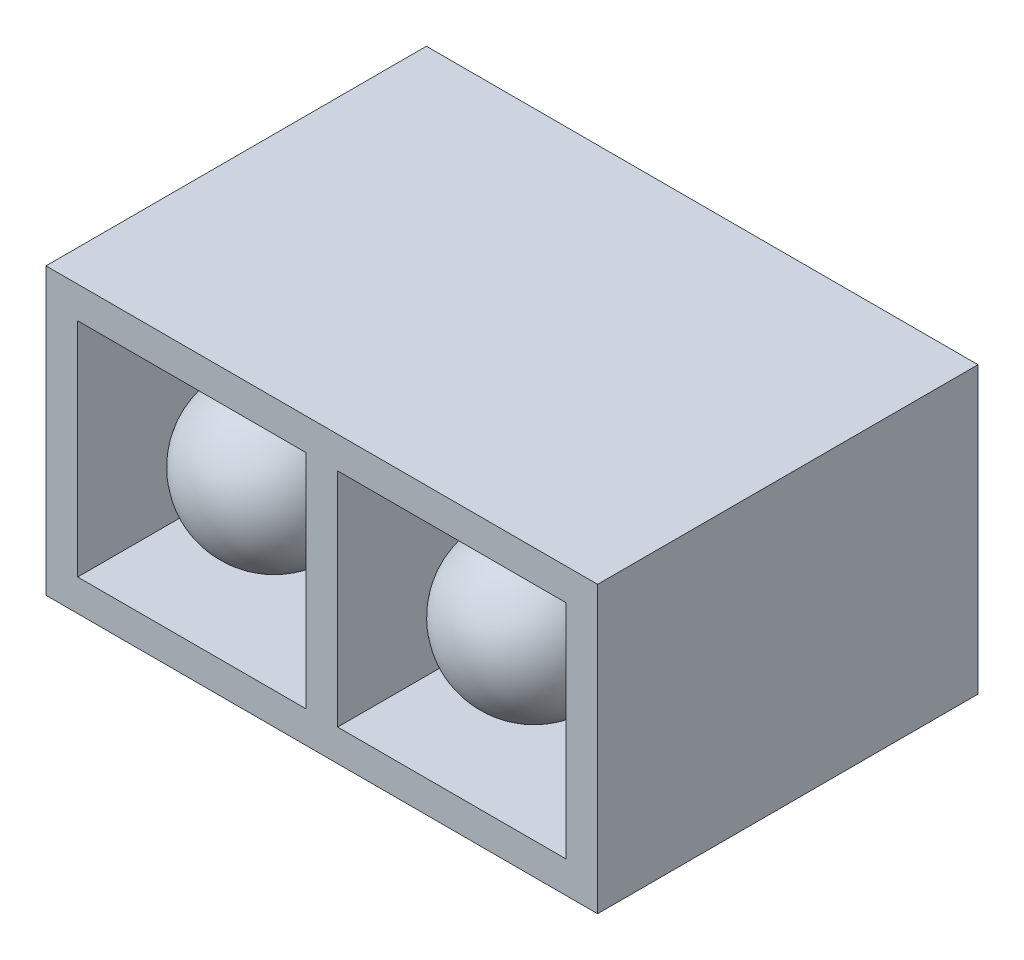
ISO-10303-21;
HEADER;
FILE_DESCRIPTION(('STEP AP214'),'2;1');
FILE_NAME('part.step','',(''),(''),'','','');
FILE_SCHEMA(('AUTOMOTIVE_DESIGN { 1 0 10303 214 1 1 1 1 }'));
ENDSEC;
DATA;
#1=APPLICATION_CONTEXT('core data for automotive mechanical design processes');
#2=APPLICATION_PROTOCOL_DEFINITION('international standard','automotive_design',2000,#1);
#3=PRODUCT_CONTEXT('',#1,'mechanical');
#4=PRODUCT('Part','Part','',(#3));
#5=PRODUCT_RELATED_PRODUCT_CATEGORY('part','',(#4));
#6=PRODUCT_DEFINITION_FORMATION('','',#4);
#7=PRODUCT_DEFINITION_CONTEXT('part definition',#1,'design');
#8=PRODUCT_DEFINITION('design','',#6,#7);
#9=PRODUCT_DEFINITION_SHAPE('','',#8);
#10=(LENGTH_UNIT() NAMED_UNIT(*) SI_UNIT(.MILLI.,.METRE.));
#11=(NAMED_UNIT(*) PLANE_ANGLE_UNIT() SI_UNIT($,.RADIAN.));
#12=(NAMED_UNIT(*) SI_UNIT($,.STERADIAN.) SOLID_ANGLE_UNIT());
#13=UNCERTAINTY_MEASURE_WITH_UNIT(LENGTH_MEASURE(1.E-05),#10,'distance_accuracy_value','');
#14=(GEOMETRIC_REPRESENTATION_CONTEXT(3) GLOBAL_UNCERTAINTY_ASSIGNED_CONTEXT((#13)) GLOBAL_UNIT_ASSIGNED_CONTEXT((#10,
#11,#12)) REPRESENTATION_CONTEXT('',''));
#15=CARTESIAN_POINT('',(0.,0.,0.));
#16=DIRECTION('',(0.,0.,1.));
#17=DIRECTION('',(1.,0.,0.));
#18=AXIS2_PLACEMENT_3D('',#15,#16,#17);
#19=CARTESIAN_POINT('',(-4.35,-1.75,6.));
#20=DIRECTION('',(0.,1.,0.));
#21=DIRECTION('',(-1.,0.,0.));
#22=AXIS2_PLACEMENT_3D('',#19,#20,#21);
#23=PLANE('',#22);
#24=DIRECTION('',(0.,0.,-1.));
#25=VECTOR('',#24,1.);
#26=CARTESIAN_POINT('',(-0.249999999999999,-1.75,6.));
#27=LINE('',#26,#25);
#28=CARTESIAN_POINT('',(-0.249999999999999,-1.75,6.));
#29=VERTEX_POINT('',#28);
#30=CARTESIAN_POINT('',(-0.249999999999999,-1.75,2.));
#31=VERTEX_POINT('',#30);
#32=EDGE_CURVE('E157',#29,#31,#27,.T.);
#33=ORIENTED_EDGE('',*,*,#32,.T.);
#34=DIRECTION('',(-1.,0.,0.));
#35=VECTOR('',#34,1.);
#36=CARTESIAN_POINT('',(-4.35,-1.75,2.));
#37=LINE('',#36,#35);
#38=CARTESIAN_POINT('',(-3.85,-1.75,2.));
#39=VERTEX_POINT('',#38);
#40=EDGE_CURVE('E73',#31,#39,#37,.T.);
#41=ORIENTED_EDGE('',*,*,#40,.T.);
#42=DIRECTION('',(0.,0.,-1.));
#43=VECTOR('',#42,1.);
#44=CARTESIAN_POINT('',(-3.85,-1.75,6.));
#45=LINE('',#44,#43);
#46=CARTESIAN_POINT('',(-3.85,-1.75,6.));
#47=VERTEX_POINT('',#46);
#48=EDGE_CURVE('E213',#47,#39,#45,.T.);
#49=ORIENTED_EDGE('',*,*,#48,.F.);
#50=DIRECTION('',(1.,0.,0.));
#51=VECTOR('',#50,1.);
#52=CARTESIAN_POINT('',(-4.35,-1.75,6.));
#53=LINE('',#52,#51);
#54=EDGE_CURVE('E198',#47,#29,#53,.T.);
#55=ORIENTED_EDGE('',*,*,#54,.T.);
#56=EDGE_LOOP('',(#33,#41,#49,#55));
#57=FACE_BOUND('',#56,.T.);
#58=ADVANCED_FACE('F58',(#57),#23,.T.);
#59=DIRECTION('',(0.,0.,-1.));
#60=VECTOR('',#59,1.);
#61=CARTESIAN_POINT('',(3.85,-1.75,6.));
#62=LINE('',#61,#60);
#63=CARTESIAN_POINT('',(3.85,-1.75,6.));
#64=VERTEX_POINT('',#63);
#65=CARTESIAN_POINT('',(3.85,-1.75,2.));
#66=VERTEX_POINT('',#65);
#67=EDGE_CURVE('E164',#64,#66,#62,.T.);
#68=ORIENTED_EDGE('',*,*,#67,.T.);
#69=DIRECTION('',(-1.,0.,0.));
#70=VECTOR('',#69,1.);
#71=CARTESIAN_POINT('',(-4.35,-1.75,2.));
#72=LINE('',#71,#70);
#73=CARTESIAN_POINT('',(0.25,-1.75,2.));
#74=VERTEX_POINT('',#73);
#75=EDGE_CURVE('E161',#66,#74,#72,.T.);
#76=ORIENTED_EDGE('',*,*,#75,.T.);
#77=DIRECTION('',(0.,0.,1.));
#78=VECTOR('',#77,1.);
#79=CARTESIAN_POINT('',(0.250000000000001,-1.75,6.));
#80=LINE('',#79,#78);
#81=CARTESIAN_POINT('',(0.25,-1.75,6.));
#82=VERTEX_POINT('',#81);
#83=EDGE_CURVE('E149',#74,#82,#80,.T.);
#84=ORIENTED_EDGE('',*,*,#83,.T.);
#85=EDGE_CURVE('E197',#82,#64,#53,.T.);
#86=ORIENTED_EDGE('',*,*,#85,.T.);
#87=EDGE_LOOP('',(#68,#76,#84,#86));
#88=FACE_BOUND('',#87,.T.);
#89=ADVANCED_FACE('F162',(#88),#23,.T.);
#90=CARTESIAN_POINT('',(-4.35,1.75,6.));
#91=DIRECTION('',(0.,-1.,0.));
#92=DIRECTION('',(1.,0.,0.));
#93=AXIS2_PLACEMENT_3D('',#90,#91,#92);
#94=PLANE('',#93);
#95=DIRECTION('',(0.,0.,-1.));
#96=VECTOR('',#95,1.);
#97=CARTESIAN_POINT('',(-3.85,1.75,6.));
#98=LINE('',#97,#96);
#99=CARTESIAN_POINT('',(-3.85,1.75,6.));
#100=VERTEX_POINT('',#99);
#101=CARTESIAN_POINT('',(-3.85,1.75,2.));
#102=VERTEX_POINT('',#101);
#103=EDGE_CURVE('E208',#100,#102,#98,.T.);
#104=ORIENTED_EDGE('',*,*,#103,.T.);
#105=DIRECTION('',(1.,0.,0.));
#106=VECTOR('',#105,1.);
#107=CARTESIAN_POINT('',(-4.35,1.75,2.));
#108=LINE('',#107,#106);
#109=CARTESIAN_POINT('',(-0.25,1.75,2.));
#110=VERTEX_POINT('',#109);
#111=EDGE_CURVE('E185',#102,#110,#108,.T.);
#112=ORIENTED_EDGE('',*,*,#111,.T.);
#113=DIRECTION('',(0.,0.,1.));
#114=VECTOR('',#113,1.);
#115=CARTESIAN_POINT('',(-0.25,1.75,6.));
#116=LINE('',#115,#114);
#117=CARTESIAN_POINT('',(-0.25,1.75,6.));
#118=VERTEX_POINT('',#117);
#119=EDGE_CURVE('E66',#110,#118,#116,.T.);
#120=ORIENTED_EDGE('',*,*,#119,.T.);
#121=DIRECTION('',(-1.,0.,0.));
#122=VECTOR('',#121,1.);
#123=CARTESIAN_POINT('',(-4.35,1.75,6.));
#124=LINE('',#123,#122);
#125=EDGE_CURVE('E204',#118,#100,#124,.T.);
#126=ORIENTED_EDGE('',*,*,#125,.T.);
#127=EDGE_LOOP('',(#104,#112,#120,#126));
#128=FACE_BOUND('',#127,.T.);
#129=ADVANCED_FACE('F247',(#128),#94,.T.);
#130=DIRECTION('',(0.,0.,-1.));
#131=VECTOR('',#130,1.);
#132=CARTESIAN_POINT('',(0.25,1.75,6.));
#133=LINE('',#132,#131);
#134=CARTESIAN_POINT('',(0.25,1.75,6.));
#135=VERTEX_POINT('',#134);
#136=CARTESIAN_POINT('',(0.25,1.75,2.));
#137=VERTEX_POINT('',#136);
#138=EDGE_CURVE('E244',#135,#137,#133,.T.);
#139=ORIENTED_EDGE('',*,*,#138,.T.);
#140=DIRECTION('',(1.,0.,0.));
#141=VECTOR('',#140,1.);
#142=CARTESIAN_POINT('',(-4.35,1.75,2.));
#143=LINE('',#142,#141);
#144=CARTESIAN_POINT('',(3.85,1.75,2.));
#145=VERTEX_POINT('',#144);
#146=EDGE_CURVE('E168',#137,#145,#143,.T.);
#147=ORIENTED_EDGE('',*,*,#146,.T.);
#148=DIRECTION('',(0.,0.,-1.));
#149=VECTOR('',#148,1.);
#150=CARTESIAN_POINT('',(3.85,1.75,6.));
#151=LINE('',#150,#149);
#152=CARTESIAN_POINT('',(3.85,1.75,6.));
#153=VERTEX_POINT('',#152);
#154=EDGE_CURVE('E210',#153,#145,#151,.T.);
#155=ORIENTED_EDGE('',*,*,#154,.F.);
#156=EDGE_CURVE('E205',#153,#135,#124,.T.);
#157=ORIENTED_EDGE('',*,*,#156,.T.);
#158=EDGE_LOOP('',(#139,#147,#155,#157));
#159=FACE_BOUND('',#158,.T.);
#160=ADVANCED_FACE('F285',(#159),#94,.T.);
#161=CARTESIAN_POINT('',(-3.85,2.25,6.));
#162=DIRECTION('',(1.,0.,0.));
#163=DIRECTION('',(0.,0.,-1.));
#164=AXIS2_PLACEMENT_3D('',#161,#162,#163);
#165=PLANE('',#164);
#166=ORIENTED_EDGE('',*,*,#48,.T.);
#167=DIRECTION('',(0.,1.,0.));
#168=VECTOR('',#167,1.);
#169=CARTESIAN_POINT('',(-3.85,2.25,2.));
#170=LINE('',#169,#168);
#171=EDGE_CURVE('E80',#39,#102,#170,.T.);
#172=ORIENTED_EDGE('',*,*,#171,.T.);
#173=ORIENTED_EDGE('',*,*,#103,.F.);
#174=DIRECTION('',(0.,-1.,0.));
#175=VECTOR('',#174,1.);
#176=CARTESIAN_POINT('',(-3.85,2.25,6.));
#177=LINE('',#176,#175);
#178=EDGE_CURVE('E195',#100,#47,#177,.T.);
#179=ORIENTED_EDGE('',*,*,#178,.T.);
#180=EDGE_LOOP('',(#166,#172,#173,#179));
#181=FACE_BOUND('',#180,.T.);
#182=ADVANCED_FACE('F257',(#181),#165,.T.);
#183=CARTESIAN_POINT('',(3.85,2.25,6.));
#184=DIRECTION('',(-1.,0.,0.));
#185=DIRECTION('',(0.,-1.,0.));
#186=AXIS2_PLACEMENT_3D('',#183,#184,#185);
#187=PLANE('',#186);
#188=ORIENTED_EDGE('',*,*,#154,.T.);
#189=DIRECTION('',(0.,-1.,0.));
#190=VECTOR('',#189,1.);
#191=CARTESIAN_POINT('',(3.85,2.25,2.));
#192=LINE('',#191,#190);
#193=EDGE_CURVE('E167',#145,#66,#192,.T.);
#194=ORIENTED_EDGE('',*,*,#193,.T.);
#195=ORIENTED_EDGE('',*,*,#67,.F.);
#196=DIRECTION('',(0.,1.,0.));
#197=VECTOR('',#196,1.);
#198=CARTESIAN_POINT('',(3.85,2.25,6.));
#199=LINE('',#198,#197);
#200=EDGE_CURVE('E201',#64,#153,#199,.T.);
#201=ORIENTED_EDGE('',*,*,#200,.T.);
#202=EDGE_LOOP('',(#188,#194,#195,#201));
#203=FACE_BOUND('',#202,.T.);
#204=ADVANCED_FACE('F281',(#203),#187,.T.);
#205=CARTESIAN_POINT('',(-0.25,2.25,6.));
#206=DIRECTION('',(1.,0.,0.));
#207=DIRECTION('',(0.,1.,0.));
#208=AXIS2_PLACEMENT_3D('',#205,#206,#207);
#209=PLANE('',#208);
#210=DIRECTION('',(0.,1.,0.));
#211=VECTOR('',#210,1.);
#212=CARTESIAN_POINT('',(-0.25,2.25,2.));
#213=LINE('',#212,#211);
#214=EDGE_CURVE('E182',#31,#110,#213,.T.);
#215=ORIENTED_EDGE('',*,*,#214,.F.);
#216=ORIENTED_EDGE('',*,*,#32,.F.);
#217=DIRECTION('',(0.,-1.,0.));
#218=VECTOR('',#217,1.);
#219=CARTESIAN_POINT('',(-0.25,2.25,6.));
#220=LINE('',#219,#218);
#221=EDGE_CURVE('E190',#118,#29,#220,.T.);
#222=ORIENTED_EDGE('',*,*,#221,.F.);
#223=ORIENTED_EDGE('',*,*,#119,.F.);
#224=EDGE_LOOP('',(#215,#216,#222,#223));
#225=FACE_BOUND('',#224,.T.);
#226=ADVANCED_FACE('F251',(#225),#209,.F.);
#227=CARTESIAN_POINT('',(0.25,2.25,6.));
#228=DIRECTION('',(-1.,0.,0.));
#229=DIRECTION('',(0.,-1.,0.));
#230=AXIS2_PLACEMENT_3D('',#227,#228,#229);
#231=PLANE('',#230);
#232=DIRECTION('',(0.,-1.,0.));
#233=VECTOR('',#232,1.);
#234=CARTESIAN_POINT('',(0.25,2.25,2.));
#235=LINE('',#234,#233);
#236=EDGE_CURVE('E12',#137,#74,#235,.T.);
#237=ORIENTED_EDGE('',*,*,#236,.F.);
#238=ORIENTED_EDGE('',*,*,#138,.F.);
#239=DIRECTION('',(0.,1.,0.));
#240=VECTOR('',#239,1.);
#241=CARTESIAN_POINT('',(0.25,2.25,6.));
#242=LINE('',#241,#240);
#243=EDGE_CURVE('E154',#82,#135,#242,.T.);
#244=ORIENTED_EDGE('',*,*,#243,.F.);
#245=ORIENTED_EDGE('',*,*,#83,.F.);
#246=EDGE_LOOP('',(#237,#238,#244,#245));
#247=FACE_BOUND('',#246,.T.);
#248=ADVANCED_FACE('F151',(#247),#231,.F.);
#249=CARTESIAN_POINT('',(0.,0.,6.));
#250=DIRECTION('',(0.,0.,1.));
#251=DIRECTION('',(1.,0.,0.));
#252=AXIS2_PLACEMENT_3D('',#249,#250,#251);
#253=PLANE('',#252);
#254=ORIENTED_EDGE('',*,*,#221,.T.);
#255=ORIENTED_EDGE('',*,*,#54,.F.);
#256=ORIENTED_EDGE('',*,*,#178,.F.);
#257=ORIENTED_EDGE('',*,*,#125,.F.);
#258=EDGE_LOOP('',(#254,#255,#256,#257));
#259=FACE_BOUND('',#258,.T.);
#260=ORIENTED_EDGE('',*,*,#243,.T.);
#261=ORIENTED_EDGE('',*,*,#156,.F.);
#262=ORIENTED_EDGE('',*,*,#200,.F.);
#263=ORIENTED_EDGE('',*,*,#85,.F.);
#264=EDGE_LOOP('',(#260,#261,#262,#263));
#265=FACE_BOUND('',#264,.T.);
#266=DIRECTION('',(-1.,0.,0.));
#267=VECTOR('',#266,1.);
#268=CARTESIAN_POINT('',(-4.35,2.25,6.));
#269=LINE('',#268,#267);
#270=CARTESIAN_POINT('',(4.35,2.25,6.));
#271=VERTEX_POINT('',#270);
#272=CARTESIAN_POINT('',(-4.35,2.25,6.));
#273=VERTEX_POINT('',#272);
#274=EDGE_CURVE('E224',#271,#273,#269,.T.);
#275=ORIENTED_EDGE('',*,*,#274,.T.);
#276=DIRECTION('',(0.,-1.,0.));
#277=VECTOR('',#276,1.);
#278=CARTESIAN_POINT('',(-4.35,2.25,6.));
#279=LINE('',#278,#277);
#280=CARTESIAN_POINT('',(-4.35,-2.25,6.));
#281=VERTEX_POINT('',#280);
#282=EDGE_CURVE('E216',#273,#281,#279,.T.);
#283=ORIENTED_EDGE('',*,*,#282,.T.);
#284=DIRECTION('',(1.,0.,0.));
#285=VECTOR('',#284,1.);
#286=CARTESIAN_POINT('',(-4.35,-2.25,6.));
#287=LINE('',#286,#285);
#288=CARTESIAN_POINT('',(4.35,-2.25,6.));
#289=VERTEX_POINT('',#288);
#290=EDGE_CURVE('E219',#281,#289,#287,.T.);
#291=ORIENTED_EDGE('',*,*,#290,.T.);
#292=DIRECTION('',(0.,1.,0.));
#293=VECTOR('',#292,1.);
#294=CARTESIAN_POINT('',(4.35,2.25,6.));
#295=LINE('',#294,#293);
#296=EDGE_CURVE('E222',#289,#271,#295,.T.);
#297=ORIENTED_EDGE('',*,*,#296,.T.);
#298=EDGE_LOOP('',(#275,#283,#291,#297));
#299=FACE_BOUND('',#298,.T.);
#300=ADVANCED_FACE('F255',(#259,#265,#299),#253,.T.);
#301=CARTESIAN_POINT('',(0.,0.,0.));
#302=DIRECTION('',(0.,0.,1.));
#303=DIRECTION('',(1.,0.,0.));
#304=AXIS2_PLACEMENT_3D('',#301,#302,#303);
#305=PLANE('',#304);
#306=DIRECTION('',(0.,-1.,0.));
#307=VECTOR('',#306,1.);
#308=CARTESIAN_POINT('',(-4.35,2.25,0.));
#309=LINE('',#308,#307);
#310=CARTESIAN_POINT('',(-4.35,2.25,0.));
#311=VERTEX_POINT('',#310);
#312=CARTESIAN_POINT('',(-4.35,-2.25,0.));
#313=VERTEX_POINT('',#312);
#314=EDGE_CURVE('E215',#311,#313,#309,.T.);
#315=ORIENTED_EDGE('',*,*,#314,.F.);
#316=DIRECTION('',(-1.,0.,0.));
#317=VECTOR('',#316,1.);
#318=CARTESIAN_POINT('',(-4.35,2.25,0.));
#319=LINE('',#318,#317);
#320=CARTESIAN_POINT('',(4.35,2.25,0.));
#321=VERTEX_POINT('',#320);
#322=EDGE_CURVE('E220',#321,#311,#319,.T.);
#323=ORIENTED_EDGE('',*,*,#322,.F.);
#324=DIRECTION('',(0.,1.,0.));
#325=VECTOR('',#324,1.);
#326=CARTESIAN_POINT('',(4.35,2.25,0.));
#327=LINE('',#326,#325);
#328=CARTESIAN_POINT('',(4.35,-2.25,0.));
#329=VERTEX_POINT('',#328);
#330=EDGE_CURVE('E232',#329,#321,#327,.T.);
#331=ORIENTED_EDGE('',*,*,#330,.F.);
#332=DIRECTION('',(1.,0.,0.));
#333=VECTOR('',#332,1.);
#334=CARTESIAN_POINT('',(-4.35,-2.25,0.));
#335=LINE('',#334,#333);
#336=EDGE_CURVE('E229',#313,#329,#335,.T.);
#337=ORIENTED_EDGE('',*,*,#336,.F.);
#338=EDGE_LOOP('',(#315,#323,#331,#337));
#339=FACE_BOUND('',#338,.T.);
#340=ADVANCED_FACE('F288',(#339),#305,.F.);
#341=CARTESIAN_POINT('',(-4.35,2.25,6.));
#342=DIRECTION('',(1.,0.,0.));
#343=DIRECTION('',(0.,0.,-1.));
#344=AXIS2_PLACEMENT_3D('',#341,#342,#343);
#345=PLANE('',#344);
#346=ORIENTED_EDGE('',*,*,#314,.T.);
#347=DIRECTION('',(0.,0.,-1.));
#348=VECTOR('',#347,1.);
#349=CARTESIAN_POINT('',(-4.35,-2.25,6.));
#350=LINE('',#349,#348);
#351=EDGE_CURVE('E242',#281,#313,#350,.T.);
#352=ORIENTED_EDGE('',*,*,#351,.F.);
#353=ORIENTED_EDGE('',*,*,#282,.F.);
#354=DIRECTION('',(0.,0.,-1.));
#355=VECTOR('',#354,1.);
#356=CARTESIAN_POINT('',(-4.35,2.25,6.));
#357=LINE('',#356,#355);
#358=EDGE_CURVE('E226',#273,#311,#357,.T.);
#359=ORIENTED_EDGE('',*,*,#358,.T.);
#360=EDGE_LOOP('',(#346,#352,#353,#359));
#361=FACE_BOUND('',#360,.T.);
#362=ADVANCED_FACE('F60',(#361),#345,.F.);
#363=CARTESIAN_POINT('',(-4.35,-2.25,6.));
#364=DIRECTION('',(0.,1.,0.));
#365=DIRECTION('',(-1.,0.,0.));
#366=AXIS2_PLACEMENT_3D('',#363,#364,#365);
#367=PLANE('',#366);
#368=ORIENTED_EDGE('',*,*,#336,.T.);
#369=DIRECTION('',(0.,0.,-1.));
#370=VECTOR('',#369,1.);
#371=CARTESIAN_POINT('',(4.35,-2.25,6.));
#372=LINE('',#371,#370);
#373=EDGE_CURVE('E240',#289,#329,#372,.T.);
#374=ORIENTED_EDGE('',*,*,#373,.F.);
#375=ORIENTED_EDGE('',*,*,#290,.F.);
#376=ORIENTED_EDGE('',*,*,#351,.T.);
#377=EDGE_LOOP('',(#368,#374,#375,#376));
#378=FACE_BOUND('',#377,.T.);
#379=ADVANCED_FACE('F297',(#378),#367,.F.);
#380=CARTESIAN_POINT('',(4.35,2.25,6.));
#381=DIRECTION('',(-1.,0.,0.));
#382=DIRECTION('',(0.,-1.,0.));
#383=AXIS2_PLACEMENT_3D('',#380,#381,#382);
#384=PLANE('',#383);
#385=ORIENTED_EDGE('',*,*,#330,.T.);
#386=DIRECTION('',(0.,0.,-1.));
#387=VECTOR('',#386,1.);
#388=CARTESIAN_POINT('',(4.35,2.25,6.));
#389=LINE('',#388,#387);
#390=EDGE_CURVE('E238',#271,#321,#389,.T.);
#391=ORIENTED_EDGE('',*,*,#390,.F.);
#392=ORIENTED_EDGE('',*,*,#296,.F.);
#393=ORIENTED_EDGE('',*,*,#373,.T.);
#394=EDGE_LOOP('',(#385,#391,#392,#393));
#395=FACE_BOUND('',#394,.T.);
#396=ADVANCED_FACE('F294',(#395),#384,.F.);
#397=CARTESIAN_POINT('',(-4.35,2.25,6.));
#398=DIRECTION('',(0.,-1.,0.));
#399=DIRECTION('',(1.,0.,0.));
#400=AXIS2_PLACEMENT_3D('',#397,#398,#399);
#401=PLANE('',#400);
#402=ORIENTED_EDGE('',*,*,#322,.T.);
#403=ORIENTED_EDGE('',*,*,#358,.F.);
#404=ORIENTED_EDGE('',*,*,#274,.F.);
#405=ORIENTED_EDGE('',*,*,#390,.T.);
#406=EDGE_LOOP('',(#402,#403,#404,#405));
#407=FACE_BOUND('',#406,.T.);
#408=ADVANCED_FACE('F271',(#407),#401,.F.);
#409=CARTESIAN_POINT('',(0.,0.,2.));
#410=DIRECTION('',(0.,0.,-1.));
#411=DIRECTION('',(-1.,0.,0.));
#412=AXIS2_PLACEMENT_3D('',#409,#410,#411);
#413=PLANE('',#412);
#414=CARTESIAN_POINT('',(2.05,0.,2.));
#415=DIRECTION('',(0.,0.,-1.));
#416=DIRECTION('',(-1.,0.,0.));
#417=AXIS2_PLACEMENT_3D('',#414,#415,#416);
#418=CIRCLE('',#417,1.2);
#419=CARTESIAN_POINT('',(0.849999999999999,0.,2.));
#420=VERTEX_POINT('',#419);
#421=EDGE_CURVE('E481',#420,#420,#418,.T.);
#422=ORIENTED_EDGE('',*,*,#421,.T.);
#423=EDGE_LOOP('',(#422));
#424=FACE_BOUND('',#423,.T.);
#425=ORIENTED_EDGE('',*,*,#193,.F.);
#426=ORIENTED_EDGE('',*,*,#146,.F.);
#427=ORIENTED_EDGE('',*,*,#236,.T.);
#428=ORIENTED_EDGE('',*,*,#75,.F.);
#429=EDGE_LOOP('',(#425,#426,#427,#428));
#430=FACE_BOUND('',#429,.T.);
#431=ADVANCED_FACE('F171',(#424,#430),#413,.F.);
#432=CARTESIAN_POINT('',(-2.05,0.,2.));
#433=DIRECTION('',(0.,0.,-1.));
#434=DIRECTION('',(-1.,0.,0.));
#435=AXIS2_PLACEMENT_3D('',#432,#433,#434);
#436=CIRCLE('',#435,1.2);
#437=CARTESIAN_POINT('',(-3.25,0.,2.));
#438=VERTEX_POINT('',#437);
#439=EDGE_CURVE('E174',#438,#438,#436,.T.);
#440=ORIENTED_EDGE('',*,*,#439,.T.);
#441=EDGE_LOOP('',(#440));
#442=FACE_BOUND('',#441,.T.);
#443=ORIENTED_EDGE('',*,*,#171,.F.);
#444=ORIENTED_EDGE('',*,*,#40,.F.);
#445=ORIENTED_EDGE('',*,*,#214,.T.);
#446=ORIENTED_EDGE('',*,*,#111,.F.);
#447=EDGE_LOOP('',(#443,#444,#445,#446));
#448=FACE_BOUND('',#447,.T.);
#449=ADVANCED_FACE('F259',(#442,#448),#413,.F.);
#450=CARTESIAN_POINT('',(-2.05,0.,1.18451766364977));
#451=DIRECTION('',(0.,0.,-1.));
#452=DIRECTION('',(-1.,0.,0.));
#453=AXIS2_PLACEMENT_3D('',#450,#451,#452);
#454=CYLINDRICAL_SURFACE('',#453,1.2);
#455=CARTESIAN_POINT('',(-2.05,0.,4.7));
#456=DIRECTION('',(0.,0.,-1.));
#457=DIRECTION('',(-1.,0.,0.));
#458=AXIS2_PLACEMENT_3D('',#455,#456,#457);
#459=CIRCLE('',#458,1.2);
#460=CARTESIAN_POINT('',(-3.25,0.,4.7));
#461=VERTEX_POINT('',#460);
#462=EDGE_CURVE('E177',#461,#461,#459,.T.);
#463=ORIENTED_EDGE('',*,*,#462,.T.);
#464=EDGE_LOOP('',(#463));
#465=FACE_BOUND('',#464,.T.);
#466=ORIENTED_EDGE('',*,*,#439,.F.);
#467=EDGE_LOOP('',(#466));
#468=FACE_BOUND('',#467,.T.);
#469=ADVANCED_FACE('F261',(#465,#468),#454,.T.);
#470=CARTESIAN_POINT('',(-2.05,0.,4.7));
#471=DIRECTION('',(0.,0.,-1.));
#472=DIRECTION('',(-1.,0.,0.));
#473=AXIS2_PLACEMENT_3D('',#470,#471,#472);
#474=SPHERICAL_SURFACE('',#473,1.2);
#475=ORIENTED_EDGE('',*,*,#462,.F.);
#476=EDGE_LOOP('',(#475));
#477=FACE_BOUND('',#476,.T.);
#478=ADVANCED_FACE('F268',(#477),#474,.T.);
#479=CARTESIAN_POINT('',(2.05,0.,4.7));
#480=DIRECTION('',(0.,0.,-1.));
#481=DIRECTION('',(-1.,0.,0.));
#482=AXIS2_PLACEMENT_3D('',#479,#480,#481);
#483=SPHERICAL_SURFACE('',#482,1.2);
#484=CARTESIAN_POINT('',(2.05,0.,4.7));
#485=DIRECTION('',(0.,0.,-1.));
#486=DIRECTION('',(-1.,0.,0.));
#487=AXIS2_PLACEMENT_3D('',#484,#485,#486);
#488=CIRCLE('',#487,1.2);
#489=CARTESIAN_POINT('',(0.849999999999999,0.,4.7));
#490=VERTEX_POINT('',#489);
#491=EDGE_CURVE('E478',#490,#490,#488,.T.);
#492=ORIENTED_EDGE('',*,*,#491,.F.);
#493=EDGE_LOOP('',(#492));
#494=FACE_BOUND('',#493,.T.);
#495=ADVANCED_FACE('F444',(#494),#483,.T.);
#496=CARTESIAN_POINT('',(2.05,0.,1.40614948103494));
#497=DIRECTION('',(0.,0.,-1.));
#498=DIRECTION('',(-1.,0.,0.));
#499=AXIS2_PLACEMENT_3D('',#496,#497,#498);
#500=CYLINDRICAL_SURFACE('',#499,1.2);
#501=ORIENTED_EDGE('',*,*,#491,.T.);
#502=EDGE_LOOP('',(#501));
#503=FACE_BOUND('',#502,.T.);
#504=ORIENTED_EDGE('',*,*,#421,.F.);
#505=EDGE_LOOP('',(#504));
#506=FACE_BOUND('',#505,.T.);
#507=ADVANCED_FACE('F458',(#503,#506),#500,.T.);
#508=CLOSED_SHELL('',(#58,#89,#129,#160,#182,#204,#226,#248,#300,#340,#362,#379,#396,#408,#431,
#449,#469,#478,#495,#507));
#509=MANIFOLD_SOLID_BREP('B2',#508);
#510=ADVANCED_BREP_SHAPE_REPRESENTATION('',(#18,#509),#14);
#511=SHAPE_DEFINITION_REPRESENTATION(#9,#510);
ENDSEC;
END-ISO-10303-21;
